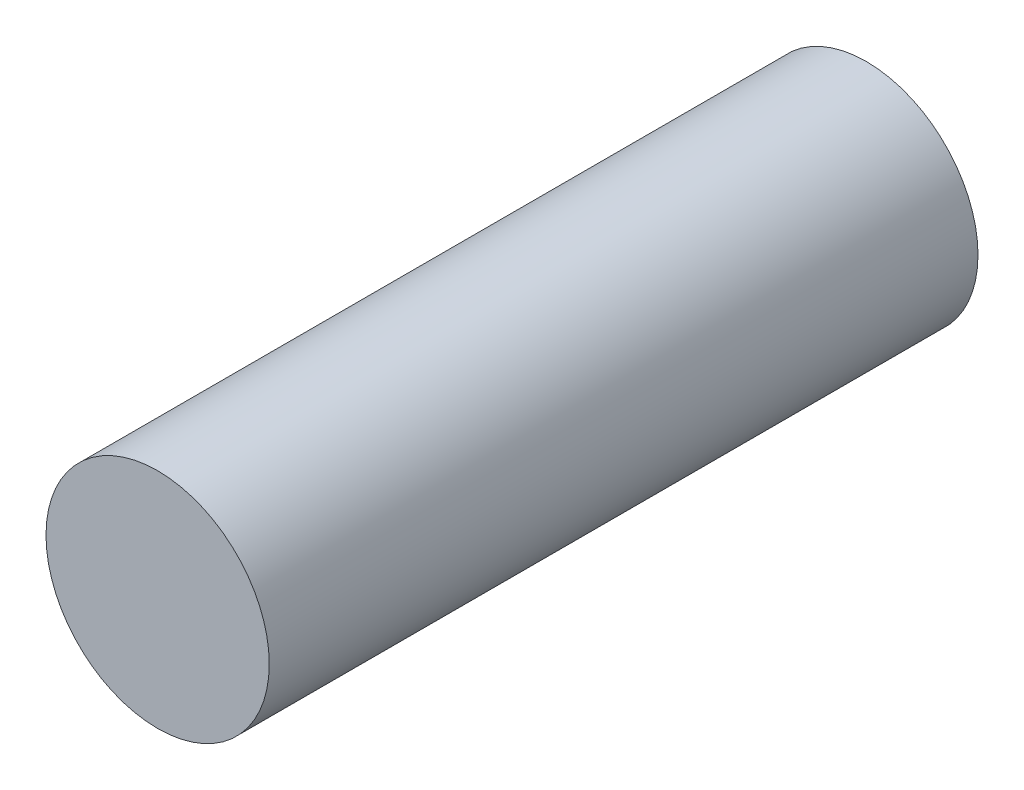
ISO-10303-21;
HEADER;
FILE_DESCRIPTION(('STEP AP214'),'2;1');
FILE_NAME('part.step','',(''),(''),'','','');
FILE_SCHEMA(('AUTOMOTIVE_DESIGN { 1 0 10303 214 1 1 1 1 }'));
ENDSEC;
DATA;
#1=APPLICATION_CONTEXT('core data for automotive mechanical design processes');
#2=APPLICATION_PROTOCOL_DEFINITION('international standard','automotive_design',2000,#1);
#3=PRODUCT_CONTEXT('',#1,'mechanical');
#4=PRODUCT('Part','Part','',(#3));
#5=PRODUCT_RELATED_PRODUCT_CATEGORY('part','',(#4));
#6=PRODUCT_DEFINITION_FORMATION('','',#4);
#7=PRODUCT_DEFINITION_CONTEXT('part definition',#1,'design');
#8=PRODUCT_DEFINITION('design','',#6,#7);
#9=PRODUCT_DEFINITION_SHAPE('','',#8);
#10=(LENGTH_UNIT() NAMED_UNIT(*) SI_UNIT(.MILLI.,.METRE.));
#11=(NAMED_UNIT(*) PLANE_ANGLE_UNIT() SI_UNIT($,.RADIAN.));
#12=(NAMED_UNIT(*) SI_UNIT($,.STERADIAN.) SOLID_ANGLE_UNIT());
#13=UNCERTAINTY_MEASURE_WITH_UNIT(LENGTH_MEASURE(1.E-05),#10,'distance_accuracy_value','');
#14=(GEOMETRIC_REPRESENTATION_CONTEXT(3) GLOBAL_UNCERTAINTY_ASSIGNED_CONTEXT((#13)) GLOBAL_UNIT_ASSIGNED_CONTEXT((#10,
#11,#12)) REPRESENTATION_CONTEXT('',''));
#15=CARTESIAN_POINT('',(0.,0.,0.));
#16=DIRECTION('',(0.,0.,1.));
#17=DIRECTION('',(1.,0.,0.));
#18=AXIS2_PLACEMENT_3D('',#15,#16,#17);
#19=CARTESIAN_POINT('',(0.,0.,101.6));
#20=DIRECTION('',(0.,0.,-1.));
#21=DIRECTION('',(-1.,0.,0.));
#22=AXIS2_PLACEMENT_3D('',#19,#20,#21);
#23=CYLINDRICAL_SURFACE('',#22,16.002);
#24=CARTESIAN_POINT('',(0.,0.,101.6));
#25=DIRECTION('',(0.,0.,1.));
#26=DIRECTION('',(1.,0.,0.));
#27=AXIS2_PLACEMENT_3D('',#24,#25,#26);
#28=CIRCLE('',#27,16.002);
#29=CARTESIAN_POINT('',(16.002,0.,101.6));
#30=VERTEX_POINT('',#29);
#31=EDGE_CURVE('E10',#30,#30,#28,.T.);
#32=ORIENTED_EDGE('',*,*,#31,.F.);
#33=EDGE_LOOP('',(#32));
#34=FACE_BOUND('',#33,.T.);
#35=CARTESIAN_POINT('',(0.,0.,0.));
#36=DIRECTION('',(0.,0.,1.));
#37=DIRECTION('',(1.,0.,0.));
#38=AXIS2_PLACEMENT_3D('',#35,#36,#37);
#39=CIRCLE('',#38,16.002);
#40=CARTESIAN_POINT('',(16.002,0.,0.));
#41=VERTEX_POINT('',#40);
#42=EDGE_CURVE('E34',#41,#41,#39,.T.);
#43=ORIENTED_EDGE('',*,*,#42,.T.);
#44=EDGE_LOOP('',(#43));
#45=FACE_BOUND('',#44,.T.);
#46=ADVANCED_FACE('F31',(#34,#45),#23,.T.);
#47=CARTESIAN_POINT('',(0.,0.,101.6));
#48=DIRECTION('',(0.,0.,1.));
#49=DIRECTION('',(1.,0.,0.));
#50=AXIS2_PLACEMENT_3D('',#47,#48,#49);
#51=PLANE('',#50);
#52=ORIENTED_EDGE('',*,*,#31,.T.);
#53=EDGE_LOOP('',(#52));
#54=FACE_BOUND('',#53,.T.);
#55=ADVANCED_FACE('F46',(#54),#51,.T.);
#56=CARTESIAN_POINT('',(0.,0.,0.));
#57=DIRECTION('',(0.,0.,1.));
#58=DIRECTION('',(1.,0.,0.));
#59=AXIS2_PLACEMENT_3D('',#56,#57,#58);
#60=PLANE('',#59);
#61=ORIENTED_EDGE('',*,*,#42,.F.);
#62=EDGE_LOOP('',(#61));
#63=FACE_BOUND('',#62,.T.);
#64=ADVANCED_FACE('F44',(#63),#60,.F.);
#65=CLOSED_SHELL('',(#46,#55,#64));
#66=MANIFOLD_SOLID_BREP('B2',#65);
#67=ADVANCED_BREP_SHAPE_REPRESENTATION('',(#18,#66),#14);
#68=SHAPE_DEFINITION_REPRESENTATION(#9,#67);
ENDSEC;
END-ISO-10303-21;
